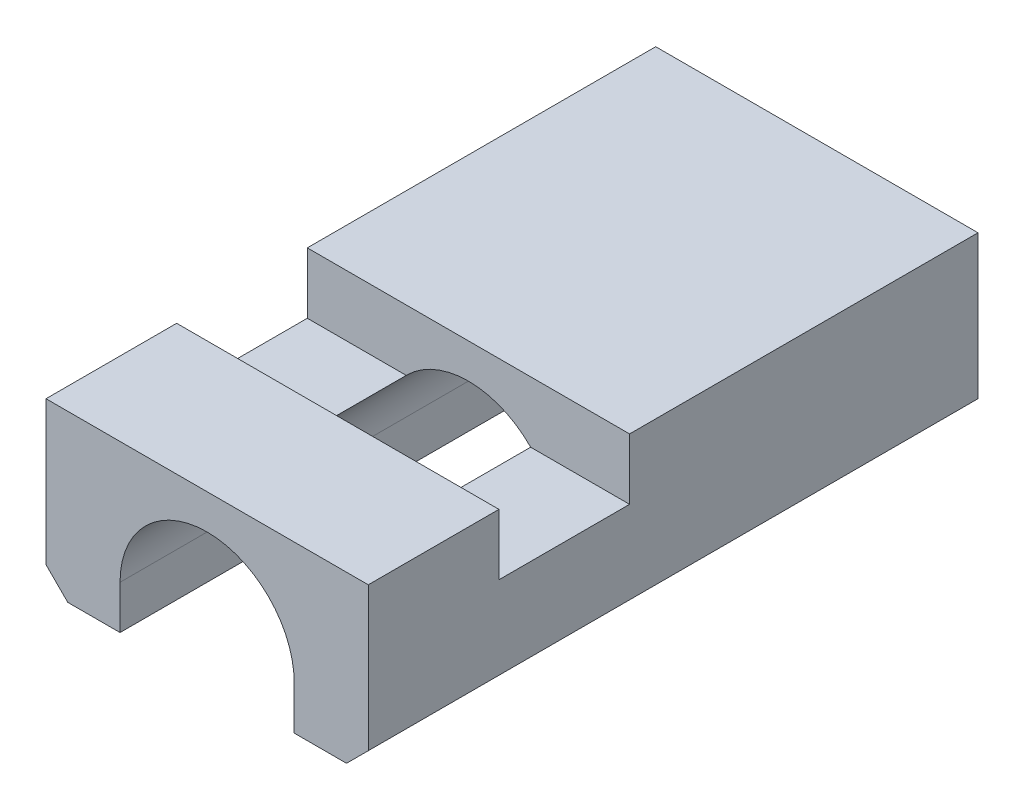
ISO-10303-21;
HEADER;
FILE_DESCRIPTION(('STEP AP214'),'2;1');
FILE_NAME('part.step','',(''),(''),'','','');
FILE_SCHEMA(('AUTOMOTIVE_DESIGN { 1 0 10303 214 1 1 1 1 }'));
ENDSEC;
DATA;
#1=APPLICATION_CONTEXT('core data for automotive mechanical design processes');
#2=APPLICATION_PROTOCOL_DEFINITION('international standard','automotive_design',2000,#1);
#3=PRODUCT_CONTEXT('',#1,'mechanical');
#4=PRODUCT('Part','Part','',(#3));
#5=PRODUCT_RELATED_PRODUCT_CATEGORY('part','',(#4));
#6=PRODUCT_DEFINITION_FORMATION('','',#4);
#7=PRODUCT_DEFINITION_CONTEXT('part definition',#1,'design');
#8=PRODUCT_DEFINITION('design','',#6,#7);
#9=PRODUCT_DEFINITION_SHAPE('','',#8);
#10=(LENGTH_UNIT() NAMED_UNIT(*) SI_UNIT(.MILLI.,.METRE.));
#11=(NAMED_UNIT(*) PLANE_ANGLE_UNIT() SI_UNIT($,.RADIAN.));
#12=(NAMED_UNIT(*) SI_UNIT($,.STERADIAN.) SOLID_ANGLE_UNIT());
#13=UNCERTAINTY_MEASURE_WITH_UNIT(LENGTH_MEASURE(1.E-05),#10,'distance_accuracy_value','');
#14=(GEOMETRIC_REPRESENTATION_CONTEXT(3) GLOBAL_UNCERTAINTY_ASSIGNED_CONTEXT((#13)) GLOBAL_UNIT_ASSIGNED_CONTEXT((#10,
#11,#12)) REPRESENTATION_CONTEXT('',''));
#15=CARTESIAN_POINT('',(0.,0.,0.));
#16=DIRECTION('',(0.,0.,1.));
#17=DIRECTION('',(1.,0.,0.));
#18=AXIS2_PLACEMENT_3D('',#15,#16,#17);
#19=CARTESIAN_POINT('',(-26.8712793989192,56.5488788418552,14.));
#20=DIRECTION('',(0.,-1.,0.));
#21=DIRECTION('',(0.,0.,-1.));
#22=AXIS2_PLACEMENT_3D('',#19,#20,#21);
#23=PLANE('',#22);
#24=DIRECTION('',(0.,0.,-1.));
#25=VECTOR('',#24,1.);
#26=CARTESIAN_POINT('',(-19.4712793989192,56.5488788418552,14.));
#27=LINE('',#26,#25);
#28=CARTESIAN_POINT('',(-19.4712793989192,56.5488788418552,14.));
#29=VERTEX_POINT('',#28);
#30=CARTESIAN_POINT('',(-19.4712793989192,56.5488788418552,11.));
#31=VERTEX_POINT('',#30);
#32=EDGE_CURVE('E236',#29,#31,#27,.T.);
#33=ORIENTED_EDGE('',*,*,#32,.T.);
#34=DIRECTION('',(1.,0.,0.));
#35=VECTOR('',#34,1.);
#36=CARTESIAN_POINT('',(-34.4712793989192,56.5488788418552,11.));
#37=LINE('',#36,#35);
#38=CARTESIAN_POINT('',(-26.8712793989192,56.5488788418552,11.));
#39=VERTEX_POINT('',#38);
#40=EDGE_CURVE('E164',#39,#31,#37,.T.);
#41=ORIENTED_EDGE('',*,*,#40,.F.);
#42=DIRECTION('',(0.,0.,-1.));
#43=VECTOR('',#42,1.);
#44=CARTESIAN_POINT('',(-26.8712793989192,56.5488788418552,14.));
#45=LINE('',#44,#43);
#46=CARTESIAN_POINT('',(-26.8712793989192,56.5488788418552,14.));
#47=VERTEX_POINT('',#46);
#48=EDGE_CURVE('E232',#47,#39,#45,.T.);
#49=ORIENTED_EDGE('',*,*,#48,.F.);
#50=DIRECTION('',(-1.,0.,0.));
#51=VECTOR('',#50,1.);
#52=CARTESIAN_POINT('',(-26.8712793989192,56.5488788418552,14.));
#53=LINE('',#52,#51);
#54=EDGE_CURVE('E202',#29,#47,#53,.T.);
#55=ORIENTED_EDGE('',*,*,#54,.F.);
#56=EDGE_LOOP('',(#33,#41,#49,#55));
#57=FACE_BOUND('',#56,.T.);
#58=ADVANCED_FACE('F34',(#57),#23,.F.);
#59=CARTESIAN_POINT('',(-25.1712793989192,52.7488788418552,14.));
#60=DIRECTION('',(-1.,0.,0.));
#61=DIRECTION('',(0.,-1.,0.));
#62=AXIS2_PLACEMENT_3D('',#59,#60,#61);
#63=PLANE('',#62);
#64=DIRECTION('',(0.,1.,0.));
#65=VECTOR('',#64,1.);
#66=CARTESIAN_POINT('',(-25.1712793989192,52.7488788418552,0.));
#67=LINE('',#66,#65);
#68=CARTESIAN_POINT('',(-25.1712793989192,52.7488788418552,0.));
#69=VERTEX_POINT('',#68);
#70=CARTESIAN_POINT('',(-25.1712793989192,53.7488788418552,0.));
#71=VERTEX_POINT('',#70);
#72=EDGE_CURVE('E188',#69,#71,#67,.T.);
#73=ORIENTED_EDGE('',*,*,#72,.T.);
#74=DIRECTION('',(0.,0.,-1.));
#75=VECTOR('',#74,1.);
#76=CARTESIAN_POINT('',(-25.1712793989192,53.7488788418552,14.));
#77=LINE('',#76,#75);
#78=CARTESIAN_POINT('',(-25.1712793989192,53.7488788418552,14.));
#79=VERTEX_POINT('',#78);
#80=EDGE_CURVE('E244',#79,#71,#77,.T.);
#81=ORIENTED_EDGE('',*,*,#80,.F.);
#82=DIRECTION('',(0.,1.,0.));
#83=VECTOR('',#82,1.);
#84=CARTESIAN_POINT('',(-25.1712793989192,52.7488788418552,14.));
#85=LINE('',#84,#83);
#86=CARTESIAN_POINT('',(-25.1712793989192,52.7488788418552,14.));
#87=VERTEX_POINT('',#86);
#88=EDGE_CURVE('E189',#87,#79,#85,.T.);
#89=ORIENTED_EDGE('',*,*,#88,.F.);
#90=DIRECTION('',(0.,0.,-1.));
#91=VECTOR('',#90,1.);
#92=CARTESIAN_POINT('',(-25.1712793989192,52.7488788418552,14.));
#93=LINE('',#92,#91);
#94=EDGE_CURVE('E209',#87,#69,#93,.T.);
#95=ORIENTED_EDGE('',*,*,#94,.T.);
#96=EDGE_LOOP('',(#73,#81,#89,#95));
#97=FACE_BOUND('',#96,.T.);
#98=ADVANCED_FACE('F295',(#97),#63,.F.);
#99=CARTESIAN_POINT('',(-23.1712793989192,53.7488788418552,14.));
#100=DIRECTION('',(0.,0.,-1.));
#101=DIRECTION('',(-1.,0.,0.));
#102=AXIS2_PLACEMENT_3D('',#99,#100,#101);
#103=CYLINDRICAL_SURFACE('',#102,2.);
#104=CARTESIAN_POINT('',(-23.1712793989192,53.7488788418552,8.));
#105=DIRECTION('',(0.,0.,-1.));
#106=DIRECTION('',(-1.,0.,0.));
#107=AXIS2_PLACEMENT_3D('',#104,#105,#106);
#108=CIRCLE('',#107,2.);
#109=CARTESIAN_POINT('',(-21.7429937132106,55.1488788418552,8.));
#110=VERTEX_POINT('',#109);
#111=CARTESIAN_POINT('',(-24.5995650846278,55.1488788418552,8.));
#112=VERTEX_POINT('',#111);
#113=EDGE_CURVE('E183',#110,#112,#108,.F.);
#114=ORIENTED_EDGE('',*,*,#113,.T.);
#115=DIRECTION('',(0.,0.,-1.));
#116=VECTOR('',#115,1.);
#117=CARTESIAN_POINT('',(-24.5995650846278,55.1488788418552,14.));
#118=LINE('',#117,#116);
#119=CARTESIAN_POINT('',(-24.5995650846278,55.1488788418552,11.));
#120=VERTEX_POINT('',#119);
#121=EDGE_CURVE('E180',#112,#120,#118,.F.);
#122=ORIENTED_EDGE('',*,*,#121,.T.);
#123=CARTESIAN_POINT('',(-23.1712793989192,53.7488788418552,11.));
#124=DIRECTION('',(0.,0.,1.));
#125=DIRECTION('',(0.,-1.,0.));
#126=AXIS2_PLACEMENT_3D('',#123,#124,#125);
#127=CIRCLE('',#126,2.);
#128=CARTESIAN_POINT('',(-21.7429937132106,55.1488788418552,11.));
#129=VERTEX_POINT('',#128);
#130=EDGE_CURVE('E186',#120,#129,#127,.F.);
#131=ORIENTED_EDGE('',*,*,#130,.T.);
#132=DIRECTION('',(0.,0.,-1.));
#133=VECTOR('',#132,1.);
#134=CARTESIAN_POINT('',(-21.7429937132106,55.1488788418552,14.));
#135=LINE('',#134,#133);
#136=EDGE_CURVE('E153',#129,#110,#135,.T.);
#137=ORIENTED_EDGE('',*,*,#136,.T.);
#138=EDGE_LOOP('',(#114,#122,#131,#137));
#139=FACE_BOUND('',#138,.T.);
#140=CARTESIAN_POINT('',(-23.1712793989192,53.7488788418552,0.));
#141=DIRECTION('',(0.,0.,-1.));
#142=DIRECTION('',(-1.,0.,0.));
#143=AXIS2_PLACEMENT_3D('',#140,#141,#142);
#144=CIRCLE('',#143,2.);
#145=CARTESIAN_POINT('',(-21.1712793989192,53.7488788418552,0.));
#146=VERTEX_POINT('',#145);
#147=EDGE_CURVE('E212',#71,#146,#144,.T.);
#148=ORIENTED_EDGE('',*,*,#147,.T.);
#149=DIRECTION('',(0.,0.,-1.));
#150=VECTOR('',#149,1.);
#151=CARTESIAN_POINT('',(-21.1712793989192,53.7488788418552,14.));
#152=LINE('',#151,#150);
#153=CARTESIAN_POINT('',(-21.1712793989192,53.7488788418552,14.));
#154=VERTEX_POINT('',#153);
#155=EDGE_CURVE('E241',#154,#146,#152,.T.);
#156=ORIENTED_EDGE('',*,*,#155,.F.);
#157=CARTESIAN_POINT('',(-23.1712793989192,53.7488788418552,14.));
#158=DIRECTION('',(0.,0.,-1.));
#159=DIRECTION('',(-1.,0.,0.));
#160=AXIS2_PLACEMENT_3D('',#157,#158,#159);
#161=CIRCLE('',#160,2.);
#162=EDGE_CURVE('E192',#79,#154,#161,.T.);
#163=ORIENTED_EDGE('',*,*,#162,.F.);
#164=ORIENTED_EDGE('',*,*,#80,.T.);
#165=EDGE_LOOP('',(#148,#156,#163,#164));
#166=FACE_BOUND('',#165,.T.);
#167=ADVANCED_FACE('F300',(#139,#166),#103,.F.);
#168=CARTESIAN_POINT('',(-21.1712793989192,53.7488788418552,14.));
#169=DIRECTION('',(1.,0.,0.));
#170=DIRECTION('',(0.,1.,0.));
#171=AXIS2_PLACEMENT_3D('',#168,#169,#170);
#172=PLANE('',#171);
#173=DIRECTION('',(0.,-1.,0.));
#174=VECTOR('',#173,1.);
#175=CARTESIAN_POINT('',(-21.1712793989192,53.7488788418552,0.));
#176=LINE('',#175,#174);
#177=CARTESIAN_POINT('',(-21.1712793989192,52.7488788418552,0.));
#178=VERTEX_POINT('',#177);
#179=EDGE_CURVE('E214',#146,#178,#176,.T.);
#180=ORIENTED_EDGE('',*,*,#179,.T.);
#181=DIRECTION('',(0.,0.,-1.));
#182=VECTOR('',#181,1.);
#183=CARTESIAN_POINT('',(-21.1712793989192,52.7488788418552,14.));
#184=LINE('',#183,#182);
#185=CARTESIAN_POINT('',(-21.1712793989192,52.7488788418552,14.));
#186=VERTEX_POINT('',#185);
#187=EDGE_CURVE('E238',#186,#178,#184,.T.);
#188=ORIENTED_EDGE('',*,*,#187,.F.);
#189=DIRECTION('',(0.,-1.,0.));
#190=VECTOR('',#189,1.);
#191=CARTESIAN_POINT('',(-21.1712793989192,53.7488788418552,14.));
#192=LINE('',#191,#190);
#193=EDGE_CURVE('E195',#154,#186,#192,.T.);
#194=ORIENTED_EDGE('',*,*,#193,.F.);
#195=ORIENTED_EDGE('',*,*,#155,.T.);
#196=EDGE_LOOP('',(#180,#188,#194,#195));
#197=FACE_BOUND('',#196,.T.);
#198=ADVANCED_FACE('F303',(#197),#172,.F.);
#199=CARTESIAN_POINT('',(-21.1712793989192,52.7488788418552,14.));
#200=DIRECTION('',(0.,1.,0.));
#201=DIRECTION('',(-1.,0.,0.));
#202=AXIS2_PLACEMENT_3D('',#199,#200,#201);
#203=PLANE('',#202);
#204=DIRECTION('',(1.,0.,0.));
#205=VECTOR('',#204,1.);
#206=CARTESIAN_POINT('',(-21.1712793989192,52.7488788418552,0.));
#207=LINE('',#206,#205);
#208=CARTESIAN_POINT('',(-19.9712793989192,52.7488788418552,0.));
#209=VERTEX_POINT('',#208);
#210=EDGE_CURVE('E216',#178,#209,#207,.T.);
#211=ORIENTED_EDGE('',*,*,#210,.T.);
#212=DIRECTION('',(0.,0.,1.));
#213=VECTOR('',#212,1.);
#214=CARTESIAN_POINT('',(-19.9712793989192,52.7488788418552,14.));
#215=LINE('',#214,#213);
#216=CARTESIAN_POINT('',(-19.9712793989192,52.7488788418552,14.));
#217=VERTEX_POINT('',#216);
#218=EDGE_CURVE('E254',#209,#217,#215,.T.);
#219=ORIENTED_EDGE('',*,*,#218,.T.);
#220=DIRECTION('',(1.,0.,0.));
#221=VECTOR('',#220,1.);
#222=CARTESIAN_POINT('',(-21.1712793989192,52.7488788418552,14.));
#223=LINE('',#222,#221);
#224=EDGE_CURVE('E197',#186,#217,#223,.T.);
#225=ORIENTED_EDGE('',*,*,#224,.F.);
#226=ORIENTED_EDGE('',*,*,#187,.T.);
#227=EDGE_LOOP('',(#211,#219,#225,#226));
#228=FACE_BOUND('',#227,.T.);
#229=ADVANCED_FACE('F307',(#228),#203,.F.);
#230=CARTESIAN_POINT('',(-19.4712793989192,53.7488788418552,14.));
#231=DIRECTION('',(-1.,0.,0.));
#232=DIRECTION('',(0.,0.,1.));
#233=AXIS2_PLACEMENT_3D('',#230,#231,#232);
#234=PLANE('',#233);
#235=DIRECTION('',(0.,0.,-1.));
#236=VECTOR('',#235,1.);
#237=CARTESIAN_POINT('',(-19.4712793989192,55.1488788418552,11.));
#238=LINE('',#237,#236);
#239=CARTESIAN_POINT('',(-19.4712793989192,55.1488788418552,11.));
#240=VERTEX_POINT('',#239);
#241=CARTESIAN_POINT('',(-19.4712793989192,55.1488788418552,8.));
#242=VERTEX_POINT('',#241);
#243=EDGE_CURVE('E150',#240,#242,#238,.T.);
#244=ORIENTED_EDGE('',*,*,#243,.F.);
#245=DIRECTION('',(0.,-1.,0.));
#246=VECTOR('',#245,1.);
#247=CARTESIAN_POINT('',(-19.4712793989192,56.5488788418552,11.));
#248=LINE('',#247,#246);
#249=EDGE_CURVE('E160',#31,#240,#248,.T.);
#250=ORIENTED_EDGE('',*,*,#249,.F.);
#251=ORIENTED_EDGE('',*,*,#32,.F.);
#252=DIRECTION('',(0.,1.,0.));
#253=VECTOR('',#252,1.);
#254=CARTESIAN_POINT('',(-19.4712793989192,52.7488788418552,14.));
#255=LINE('',#254,#253);
#256=CARTESIAN_POINT('',(-19.4712793989192,53.2488788418552,14.));
#257=VERTEX_POINT('',#256);
#258=EDGE_CURVE('E200',#257,#29,#255,.T.);
#259=ORIENTED_EDGE('',*,*,#258,.F.);
#260=DIRECTION('',(0.,0.,-1.));
#261=VECTOR('',#260,1.);
#262=CARTESIAN_POINT('',(-19.4712793989192,53.2488788418552,14.));
#263=LINE('',#262,#261);
#264=CARTESIAN_POINT('',(-19.4712793989192,53.2488788418552,0.));
#265=VERTEX_POINT('',#264);
#266=EDGE_CURVE('E247',#257,#265,#263,.T.);
#267=ORIENTED_EDGE('',*,*,#266,.T.);
#268=DIRECTION('',(0.,1.,0.));
#269=VECTOR('',#268,1.);
#270=CARTESIAN_POINT('',(-19.4712793989192,53.7488788418552,0.));
#271=LINE('',#270,#269);
#272=CARTESIAN_POINT('',(-19.4712793989192,56.5488788418552,0.));
#273=VERTEX_POINT('',#272);
#274=EDGE_CURVE('E219',#265,#273,#271,.T.);
#275=ORIENTED_EDGE('',*,*,#274,.T.);
#276=CARTESIAN_POINT('',(-19.4712793989192,56.5488788418552,8.));
#277=VERTEX_POINT('',#276);
#278=EDGE_CURVE('E235',#277,#273,#27,.T.);
#279=ORIENTED_EDGE('',*,*,#278,.F.);
#280=DIRECTION('',(0.,1.,0.));
#281=VECTOR('',#280,1.);
#282=CARTESIAN_POINT('',(-19.4712793989192,56.5488788418552,8.));
#283=LINE('',#282,#281);
#284=EDGE_CURVE('E157',#242,#277,#283,.T.);
#285=ORIENTED_EDGE('',*,*,#284,.F.);
#286=EDGE_LOOP('',(#244,#250,#251,#259,#267,#275,#279,#285));
#287=FACE_BOUND('',#286,.T.);
#288=ADVANCED_FACE('F169',(#287),#234,.F.);
#289=CARTESIAN_POINT('',(-26.8712793989192,56.5488788418552,8.));
#290=VERTEX_POINT('',#289);
#291=CARTESIAN_POINT('',(-26.8712793989192,56.5488788418552,0.));
#292=VERTEX_POINT('',#291);
#293=EDGE_CURVE('E231',#290,#292,#45,.T.);
#294=ORIENTED_EDGE('',*,*,#293,.F.);
#295=DIRECTION('',(1.,0.,0.));
#296=VECTOR('',#295,1.);
#297=CARTESIAN_POINT('',(-34.4712793989192,56.5488788418552,8.));
#298=LINE('',#297,#296);
#299=EDGE_CURVE('E175',#290,#277,#298,.T.);
#300=ORIENTED_EDGE('',*,*,#299,.T.);
#301=ORIENTED_EDGE('',*,*,#278,.T.);
#302=DIRECTION('',(-1.,0.,0.));
#303=VECTOR('',#302,1.);
#304=CARTESIAN_POINT('',(-26.8712793989192,56.5488788418552,0.));
#305=LINE('',#304,#303);
#306=EDGE_CURVE('E222',#273,#292,#305,.T.);
#307=ORIENTED_EDGE('',*,*,#306,.T.);
#308=EDGE_LOOP('',(#294,#300,#301,#307));
#309=FACE_BOUND('',#308,.T.);
#310=ADVANCED_FACE('F274',(#309),#23,.F.);
#311=CARTESIAN_POINT('',(-26.8712793989192,53.7488788418552,14.));
#312=DIRECTION('',(1.,0.,0.));
#313=DIRECTION('',(0.,0.,-1.));
#314=AXIS2_PLACEMENT_3D('',#311,#312,#313);
#315=PLANE('',#314);
#316=ORIENTED_EDGE('',*,*,#48,.T.);
#317=DIRECTION('',(0.,-1.,0.));
#318=VECTOR('',#317,1.);
#319=CARTESIAN_POINT('',(-26.8712793989192,53.7488788418552,11.));
#320=LINE('',#319,#318);
#321=CARTESIAN_POINT('',(-26.8712793989192,55.1488788418552,11.));
#322=VERTEX_POINT('',#321);
#323=EDGE_CURVE('E11',#39,#322,#320,.T.);
#324=ORIENTED_EDGE('',*,*,#323,.T.);
#325=DIRECTION('',(0.,0.,-1.));
#326=VECTOR('',#325,1.);
#327=CARTESIAN_POINT('',(-26.8712793989192,55.1488788418552,14.));
#328=LINE('',#327,#326);
#329=CARTESIAN_POINT('',(-26.8712793989192,55.1488788418552,8.));
#330=VERTEX_POINT('',#329);
#331=EDGE_CURVE('E265',#322,#330,#328,.T.);
#332=ORIENTED_EDGE('',*,*,#331,.T.);
#333=DIRECTION('',(0.,1.,0.));
#334=VECTOR('',#333,1.);
#335=CARTESIAN_POINT('',(-26.8712793989192,53.7488788418552,8.));
#336=LINE('',#335,#334);
#337=EDGE_CURVE('E43',#330,#290,#336,.T.);
#338=ORIENTED_EDGE('',*,*,#337,.T.);
#339=ORIENTED_EDGE('',*,*,#293,.T.);
#340=DIRECTION('',(0.,-1.,0.));
#341=VECTOR('',#340,1.);
#342=CARTESIAN_POINT('',(-26.8712793989192,53.7488788418552,0.));
#343=LINE('',#342,#341);
#344=CARTESIAN_POINT('',(-26.8712793989192,53.2488788418552,0.));
#345=VERTEX_POINT('',#344);
#346=EDGE_CURVE('E225',#292,#345,#343,.T.);
#347=ORIENTED_EDGE('',*,*,#346,.T.);
#348=DIRECTION('',(0.,0.,1.));
#349=VECTOR('',#348,1.);
#350=CARTESIAN_POINT('',(-26.8712793989192,53.2488788418552,14.));
#351=LINE('',#350,#349);
#352=CARTESIAN_POINT('',(-26.8712793989192,53.2488788418552,14.));
#353=VERTEX_POINT('',#352);
#354=EDGE_CURVE('E263',#345,#353,#351,.T.);
#355=ORIENTED_EDGE('',*,*,#354,.T.);
#356=DIRECTION('',(0.,-1.,0.));
#357=VECTOR('',#356,1.);
#358=CARTESIAN_POINT('',(-26.8712793989192,53.7488788418552,14.));
#359=LINE('',#358,#357);
#360=EDGE_CURVE('E204',#47,#353,#359,.T.);
#361=ORIENTED_EDGE('',*,*,#360,.F.);
#362=EDGE_LOOP('',(#316,#324,#332,#338,#339,#347,#355,#361));
#363=FACE_BOUND('',#362,.T.);
#364=ADVANCED_FACE('F270',(#363),#315,.F.);
#365=CARTESIAN_POINT('',(-26.8712793989192,52.7488788418552,14.));
#366=DIRECTION('',(0.,1.,0.));
#367=DIRECTION('',(0.,0.,1.));
#368=AXIS2_PLACEMENT_3D('',#365,#366,#367);
#369=PLANE('',#368);
#370=DIRECTION('',(1.,0.,0.));
#371=VECTOR('',#370,1.);
#372=CARTESIAN_POINT('',(-26.8712793989192,52.7488788418552,14.));
#373=LINE('',#372,#371);
#374=CARTESIAN_POINT('',(-26.3712793989192,52.7488788418552,14.));
#375=VERTEX_POINT('',#374);
#376=EDGE_CURVE('E207',#375,#87,#373,.T.);
#377=ORIENTED_EDGE('',*,*,#376,.F.);
#378=DIRECTION('',(0.,0.,-1.));
#379=VECTOR('',#378,1.);
#380=CARTESIAN_POINT('',(-26.3712793989192,52.7488788418552,14.));
#381=LINE('',#380,#379);
#382=CARTESIAN_POINT('',(-26.3712793989192,52.7488788418552,0.));
#383=VERTEX_POINT('',#382);
#384=EDGE_CURVE('E260',#375,#383,#381,.T.);
#385=ORIENTED_EDGE('',*,*,#384,.T.);
#386=DIRECTION('',(1.,0.,0.));
#387=VECTOR('',#386,1.);
#388=CARTESIAN_POINT('',(-26.8712793989192,52.7488788418552,0.));
#389=LINE('',#388,#387);
#390=EDGE_CURVE('E193',#383,#69,#389,.T.);
#391=ORIENTED_EDGE('',*,*,#390,.T.);
#392=ORIENTED_EDGE('',*,*,#94,.F.);
#393=EDGE_LOOP('',(#377,#385,#391,#392));
#394=FACE_BOUND('',#393,.T.);
#395=ADVANCED_FACE('F290',(#394),#369,.F.);
#396=CARTESIAN_POINT('',(-23.1712793989192,53.7488788418552,14.));
#397=DIRECTION('',(0.,0.,-1.));
#398=DIRECTION('',(-1.,0.,0.));
#399=AXIS2_PLACEMENT_3D('',#396,#397,#398);
#400=PLANE('',#399);
#401=ORIENTED_EDGE('',*,*,#224,.T.);
#402=DIRECTION('',(-0.707106781186545,-0.70710678118655,0.));
#403=VECTOR('',#402,1.);
#404=CARTESIAN_POINT('',(-19.4712793989192,53.2488788418552,14.));
#405=LINE('',#404,#403);
#406=EDGE_CURVE('E258',#217,#257,#405,.F.);
#407=ORIENTED_EDGE('',*,*,#406,.T.);
#408=ORIENTED_EDGE('',*,*,#258,.T.);
#409=ORIENTED_EDGE('',*,*,#54,.T.);
#410=ORIENTED_EDGE('',*,*,#360,.T.);
#411=DIRECTION('',(-0.707106781186543,0.707106781186552,0.));
#412=VECTOR('',#411,1.);
#413=CARTESIAN_POINT('',(-26.3712793989192,52.7488788418552,14.));
#414=LINE('',#413,#412);
#415=EDGE_CURVE('E256',#353,#375,#414,.F.);
#416=ORIENTED_EDGE('',*,*,#415,.T.);
#417=ORIENTED_EDGE('',*,*,#376,.T.);
#418=ORIENTED_EDGE('',*,*,#88,.T.);
#419=ORIENTED_EDGE('',*,*,#162,.T.);
#420=ORIENTED_EDGE('',*,*,#193,.T.);
#421=EDGE_LOOP('',(#401,#407,#408,#409,#410,#416,#417,#418,#419,#420));
#422=FACE_BOUND('',#421,.T.);
#423=ADVANCED_FACE('F287',(#422),#400,.F.);
#424=CARTESIAN_POINT('',(-23.1712793989192,53.7488788418552,0.));
#425=DIRECTION('',(0.,0.,-1.));
#426=DIRECTION('',(-1.,0.,0.));
#427=AXIS2_PLACEMENT_3D('',#424,#425,#426);
#428=PLANE('',#427);
#429=ORIENTED_EDGE('',*,*,#274,.F.);
#430=DIRECTION('',(0.707106781186545,0.70710678118655,0.));
#431=VECTOR('',#430,1.);
#432=CARTESIAN_POINT('',(-21.0712793989192,51.6488788418552,0.));
#433=LINE('',#432,#431);
#434=EDGE_CURVE('E252',#265,#209,#433,.F.);
#435=ORIENTED_EDGE('',*,*,#434,.T.);
#436=ORIENTED_EDGE('',*,*,#210,.F.);
#437=ORIENTED_EDGE('',*,*,#179,.F.);
#438=ORIENTED_EDGE('',*,*,#147,.F.);
#439=ORIENTED_EDGE('',*,*,#72,.F.);
#440=ORIENTED_EDGE('',*,*,#390,.F.);
#441=DIRECTION('',(0.707106781186543,-0.707106781186552,0.));
#442=VECTOR('',#441,1.);
#443=CARTESIAN_POINT('',(-25.2712793989192,51.6488788418552,0.));
#444=LINE('',#443,#442);
#445=EDGE_CURVE('E250',#383,#345,#444,.F.);
#446=ORIENTED_EDGE('',*,*,#445,.T.);
#447=ORIENTED_EDGE('',*,*,#346,.F.);
#448=ORIENTED_EDGE('',*,*,#306,.F.);
#449=EDGE_LOOP('',(#429,#435,#436,#437,#438,#439,#440,#446,#447,#448));
#450=FACE_BOUND('',#449,.T.);
#451=ADVANCED_FACE('F278',(#450),#428,.T.);
#452=CARTESIAN_POINT('',(-19.4712793989192,53.2488788418552,14.));
#453=DIRECTION('',(-0.70710678118655,0.707106781186545,0.));
#454=DIRECTION('',(0.,0.,-1.));
#455=AXIS2_PLACEMENT_3D('',#452,#453,#454);
#456=PLANE('',#455);
#457=ORIENTED_EDGE('',*,*,#406,.F.);
#458=ORIENTED_EDGE('',*,*,#218,.F.);
#459=ORIENTED_EDGE('',*,*,#434,.F.);
#460=ORIENTED_EDGE('',*,*,#266,.F.);
#461=EDGE_LOOP('',(#457,#458,#459,#460));
#462=FACE_BOUND('',#461,.T.);
#463=ADVANCED_FACE('F313',(#462),#456,.F.);
#464=CARTESIAN_POINT('',(-26.3712793989192,52.7488788418552,14.));
#465=DIRECTION('',(0.707106781186552,0.707106781186543,0.));
#466=DIRECTION('',(0.,0.,-1.));
#467=AXIS2_PLACEMENT_3D('',#464,#465,#466);
#468=PLANE('',#467);
#469=ORIENTED_EDGE('',*,*,#415,.F.);
#470=ORIENTED_EDGE('',*,*,#354,.F.);
#471=ORIENTED_EDGE('',*,*,#445,.F.);
#472=ORIENTED_EDGE('',*,*,#384,.F.);
#473=EDGE_LOOP('',(#469,#470,#471,#472));
#474=FACE_BOUND('',#473,.T.);
#475=ADVANCED_FACE('F37',(#474),#468,.F.);
#476=CARTESIAN_POINT('',(-34.4712793989192,56.5488788418552,11.));
#477=DIRECTION('',(0.,0.,1.));
#478=DIRECTION('',(0.,-1.,0.));
#479=AXIS2_PLACEMENT_3D('',#476,#477,#478);
#480=PLANE('',#479);
#481=DIRECTION('',(1.,0.,0.));
#482=VECTOR('',#481,1.);
#483=CARTESIAN_POINT('',(-34.4712793989192,55.1488788418552,11.));
#484=LINE('',#483,#482);
#485=EDGE_CURVE('E156',#322,#120,#484,.T.);
#486=ORIENTED_EDGE('',*,*,#485,.F.);
#487=ORIENTED_EDGE('',*,*,#323,.F.);
#488=ORIENTED_EDGE('',*,*,#40,.T.);
#489=ORIENTED_EDGE('',*,*,#249,.T.);
#490=EDGE_CURVE('E146',#129,#240,#484,.T.);
#491=ORIENTED_EDGE('',*,*,#490,.F.);
#492=ORIENTED_EDGE('',*,*,#130,.F.);
#493=EDGE_LOOP('',(#486,#487,#488,#489,#491,#492));
#494=FACE_BOUND('',#493,.T.);
#495=ADVANCED_FACE('F162',(#494),#480,.F.);
#496=CARTESIAN_POINT('',(-34.4712793989192,56.5488788418552,8.));
#497=DIRECTION('',(0.,0.,-1.));
#498=DIRECTION('',(-1.,0.,0.));
#499=AXIS2_PLACEMENT_3D('',#496,#497,#498);
#500=PLANE('',#499);
#501=DIRECTION('',(1.,0.,0.));
#502=VECTOR('',#501,1.);
#503=CARTESIAN_POINT('',(-34.4712793989192,55.1488788418552,8.));
#504=LINE('',#503,#502);
#505=EDGE_CURVE('E50',#110,#242,#504,.T.);
#506=ORIENTED_EDGE('',*,*,#505,.T.);
#507=ORIENTED_EDGE('',*,*,#284,.T.);
#508=ORIENTED_EDGE('',*,*,#299,.F.);
#509=ORIENTED_EDGE('',*,*,#337,.F.);
#510=EDGE_CURVE('E58',#330,#112,#504,.T.);
#511=ORIENTED_EDGE('',*,*,#510,.T.);
#512=ORIENTED_EDGE('',*,*,#113,.F.);
#513=EDGE_LOOP('',(#506,#507,#508,#509,#511,#512));
#514=FACE_BOUND('',#513,.T.);
#515=ADVANCED_FACE('F320',(#514),#500,.F.);
#516=CARTESIAN_POINT('',(-34.4712793989192,55.1488788418552,11.));
#517=DIRECTION('',(0.,-1.,0.));
#518=DIRECTION('',(0.,0.,-1.));
#519=AXIS2_PLACEMENT_3D('',#516,#517,#518);
#520=PLANE('',#519);
#521=ORIENTED_EDGE('',*,*,#510,.F.);
#522=ORIENTED_EDGE('',*,*,#331,.F.);
#523=ORIENTED_EDGE('',*,*,#485,.T.);
#524=ORIENTED_EDGE('',*,*,#121,.F.);
#525=EDGE_LOOP('',(#521,#522,#523,#524));
#526=FACE_BOUND('',#525,.T.);
#527=ADVANCED_FACE('F318',(#526),#520,.F.);
#528=ORIENTED_EDGE('',*,*,#490,.T.);
#529=ORIENTED_EDGE('',*,*,#243,.T.);
#530=ORIENTED_EDGE('',*,*,#505,.F.);
#531=ORIENTED_EDGE('',*,*,#136,.F.);
#532=EDGE_LOOP('',(#528,#529,#530,#531));
#533=FACE_BOUND('',#532,.T.);
#534=ADVANCED_FACE('F148',(#533),#520,.F.);
#535=CLOSED_SHELL('',(#58,#98,#167,#198,#229,#288,#310,#364,#395,#423,#451,#463,#475,#495,#515,
#527,#534));
#536=MANIFOLD_SOLID_BREP('B2',#535);
#537=ADVANCED_BREP_SHAPE_REPRESENTATION('',(#18,#536),#14);
#538=SHAPE_DEFINITION_REPRESENTATION(#9,#537);
ENDSEC;
END-ISO-10303-21;
